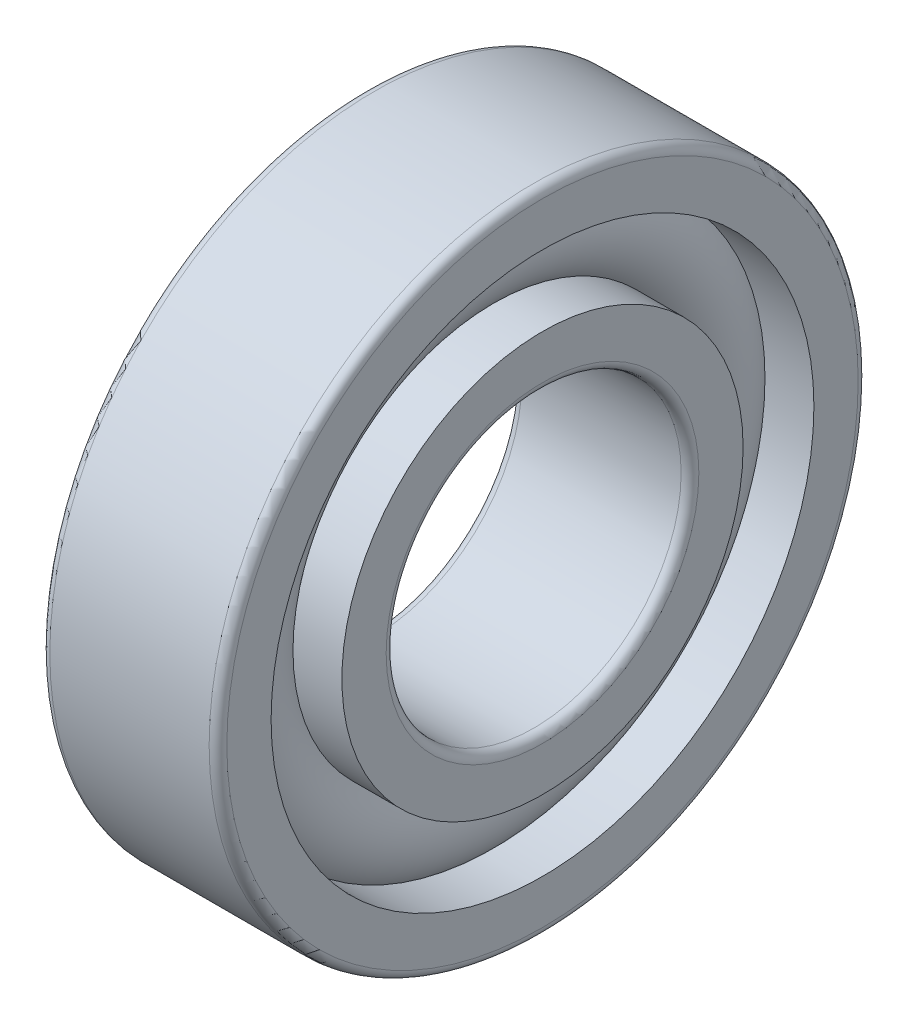
ISO-10303-21;
HEADER;
FILE_DESCRIPTION(('STEP AP214'),'2;1');
FILE_NAME('part.step','',(''),(''),'','','');
FILE_SCHEMA(('AUTOMOTIVE_DESIGN { 1 0 10303 214 1 1 1 1 }'));
ENDSEC;
DATA;
#1=APPLICATION_CONTEXT('core data for automotive mechanical design processes');
#2=APPLICATION_PROTOCOL_DEFINITION('international standard','automotive_design',2000,#1);
#3=PRODUCT_CONTEXT('',#1,'mechanical');
#4=PRODUCT('Part','Part','',(#3));
#5=PRODUCT_RELATED_PRODUCT_CATEGORY('part','',(#4));
#6=PRODUCT_DEFINITION_FORMATION('','',#4);
#7=PRODUCT_DEFINITION_CONTEXT('part definition',#1,'design');
#8=PRODUCT_DEFINITION('design','',#6,#7);
#9=PRODUCT_DEFINITION_SHAPE('','',#8);
#10=(LENGTH_UNIT() NAMED_UNIT(*) SI_UNIT(.MILLI.,.METRE.));
#11=(NAMED_UNIT(*) PLANE_ANGLE_UNIT() SI_UNIT($,.RADIAN.));
#12=(NAMED_UNIT(*) SI_UNIT($,.STERADIAN.) SOLID_ANGLE_UNIT());
#13=UNCERTAINTY_MEASURE_WITH_UNIT(LENGTH_MEASURE(1.E-05),#10,'distance_accuracy_value','');
#14=(GEOMETRIC_REPRESENTATION_CONTEXT(3) GLOBAL_UNCERTAINTY_ASSIGNED_CONTEXT((#13)) GLOBAL_UNIT_ASSIGNED_CONTEXT((#10,
#11,#12)) REPRESENTATION_CONTEXT('',''));
#15=CARTESIAN_POINT('',(0.,0.,0.));
#16=DIRECTION('',(0.,0.,1.));
#17=DIRECTION('',(1.,0.,0.));
#18=AXIS2_PLACEMENT_3D('',#15,#16,#17);
#19=CARTESIAN_POINT('',(-20.6375,0.,0.));
#20=DIRECTION('',(1.,0.,0.));
#21=DIRECTION('',(0.,0.,-1.));
#22=AXIS2_PLACEMENT_3D('',#19,#20,#21);
#23=CYLINDRICAL_SURFACE('',#22,2.5);
#24=CARTESIAN_POINT('',(1.35,0.,0.));
#25=DIRECTION('',(1.,0.,0.));
#26=DIRECTION('',(0.,0.,-1.));
#27=AXIS2_PLACEMENT_3D('',#24,#25,#26);
#28=CIRCLE('',#27,2.5);
#29=CARTESIAN_POINT('',(1.35,0.,-2.5));
#30=VERTEX_POINT('',#29);
#31=EDGE_CURVE('E68',#30,#30,#28,.F.);
#32=ORIENTED_EDGE('',*,*,#31,.F.);
#33=EDGE_LOOP('',(#32));
#34=FACE_BOUND('',#33,.T.);
#35=CARTESIAN_POINT('',(-1.35,0.,0.));
#36=DIRECTION('',(1.,0.,0.));
#37=DIRECTION('',(0.,0.,-1.));
#38=AXIS2_PLACEMENT_3D('',#35,#36,#37);
#39=CIRCLE('',#38,2.5);
#40=CARTESIAN_POINT('',(-1.35,0.,-2.5));
#41=VERTEX_POINT('',#40);
#42=EDGE_CURVE('E131',#41,#41,#39,.T.);
#43=ORIENTED_EDGE('',*,*,#42,.F.);
#44=EDGE_LOOP('',(#43));
#45=FACE_BOUND('',#44,.T.);
#46=ADVANCED_FACE('F17',(#34,#45),#23,.F.);
#47=CARTESIAN_POINT('',(-1.35,0.,0.));
#48=DIRECTION('',(1.,0.,0.));
#49=DIRECTION('',(0.,0.,-1.));
#50=AXIS2_PLACEMENT_3D('',#47,#48,#49);
#51=TOROIDAL_SURFACE('',#50,2.65,0.15);
#52=ORIENTED_EDGE('',*,*,#42,.T.);
#53=EDGE_LOOP('',(#52));
#54=FACE_BOUND('',#53,.T.);
#55=CARTESIAN_POINT('',(-1.5,0.,0.));
#56=DIRECTION('',(-1.,0.,0.));
#57=DIRECTION('',(0.,0.,-1.));
#58=AXIS2_PLACEMENT_3D('',#55,#56,#57);
#59=CIRCLE('',#58,2.65);
#60=CARTESIAN_POINT('',(-1.5,0.,2.65));
#61=VERTEX_POINT('',#60);
#62=CARTESIAN_POINT('',(-1.5,0.,-2.65));
#63=VERTEX_POINT('',#62);
#64=EDGE_CURVE('E58',#61,#63,#59,.F.);
#65=ORIENTED_EDGE('',*,*,#64,.F.);
#66=CARTESIAN_POINT('',(-1.5,0.,0.));
#67=DIRECTION('',(-1.,0.,0.));
#68=DIRECTION('',(0.,0.,1.));
#69=AXIS2_PLACEMENT_3D('',#66,#67,#68);
#70=CIRCLE('',#69,2.65);
#71=EDGE_CURVE('E56',#63,#61,#70,.F.);
#72=ORIENTED_EDGE('',*,*,#71,.F.);
#73=EDGE_LOOP('',(#65,#72));
#74=FACE_BOUND('',#73,.T.);
#75=ADVANCED_FACE('F60',(#54,#74),#51,.T.);
#76=CARTESIAN_POINT('',(1.35,0.,0.));
#77=DIRECTION('',(1.,0.,0.));
#78=DIRECTION('',(0.,0.,-1.));
#79=AXIS2_PLACEMENT_3D('',#76,#77,#78);
#80=TOROIDAL_SURFACE('',#79,2.65,0.15);
#81=CARTESIAN_POINT('',(1.5,0.,0.));
#82=DIRECTION('',(1.,0.,0.));
#83=DIRECTION('',(0.,0.,-1.));
#84=AXIS2_PLACEMENT_3D('',#81,#82,#83);
#85=CIRCLE('',#84,2.65);
#86=CARTESIAN_POINT('',(1.5,0.,2.65));
#87=VERTEX_POINT('',#86);
#88=CARTESIAN_POINT('',(1.5,0.,-2.65));
#89=VERTEX_POINT('',#88);
#90=EDGE_CURVE('E63',#87,#89,#85,.F.);
#91=ORIENTED_EDGE('',*,*,#90,.F.);
#92=CARTESIAN_POINT('',(1.5,0.,0.));
#93=DIRECTION('',(1.,0.,0.));
#94=DIRECTION('',(0.,0.,1.));
#95=AXIS2_PLACEMENT_3D('',#92,#93,#94);
#96=CIRCLE('',#95,2.65);
#97=EDGE_CURVE('E107',#89,#87,#96,.F.);
#98=ORIENTED_EDGE('',*,*,#97,.F.);
#99=EDGE_LOOP('',(#91,#98));
#100=FACE_BOUND('',#99,.T.);
#101=ORIENTED_EDGE('',*,*,#31,.T.);
#102=EDGE_LOOP('',(#101));
#103=FACE_BOUND('',#102,.T.);
#104=ADVANCED_FACE('F88',(#100,#103),#80,.T.);
#105=CARTESIAN_POINT('',(-1.5,3.4,0.));
#106=DIRECTION('',(-1.,0.,0.));
#107=DIRECTION('',(0.,0.,1.));
#108=AXIS2_PLACEMENT_3D('',#105,#106,#107);
#109=PLANE('',#108);
#110=CARTESIAN_POINT('',(-1.5,0.,0.));
#111=DIRECTION('',(1.,0.,0.));
#112=DIRECTION('',(0.,0.,-1.));
#113=AXIS2_PLACEMENT_3D('',#110,#111,#112);
#114=CIRCLE('',#113,3.4);
#115=CARTESIAN_POINT('',(-1.5,0.,-3.4));
#116=VERTEX_POINT('',#115);
#117=EDGE_CURVE('E146',#116,#116,#114,.T.);
#118=ORIENTED_EDGE('',*,*,#117,.F.);
#119=EDGE_LOOP('',(#118));
#120=FACE_BOUND('',#119,.T.);
#121=ORIENTED_EDGE('',*,*,#71,.T.);
#122=ORIENTED_EDGE('',*,*,#64,.T.);
#123=EDGE_LOOP('',(#121,#122));
#124=FACE_BOUND('',#123,.T.);
#125=ADVANCED_FACE('F67',(#120,#124),#109,.T.);
#126=CARTESIAN_POINT('',(1.5,2.65,0.));
#127=DIRECTION('',(1.,0.,0.));
#128=DIRECTION('',(0.,0.,-1.));
#129=AXIS2_PLACEMENT_3D('',#126,#127,#128);
#130=PLANE('',#129);
#131=ORIENTED_EDGE('',*,*,#90,.T.);
#132=ORIENTED_EDGE('',*,*,#97,.T.);
#133=EDGE_LOOP('',(#131,#132));
#134=FACE_BOUND('',#133,.T.);
#135=CARTESIAN_POINT('',(1.5,0.,0.));
#136=DIRECTION('',(1.,0.,0.));
#137=DIRECTION('',(0.,0.,-1.));
#138=AXIS2_PLACEMENT_3D('',#135,#136,#137);
#139=CIRCLE('',#138,3.4);
#140=CARTESIAN_POINT('',(1.5,0.,-3.4));
#141=VERTEX_POINT('',#140);
#142=EDGE_CURVE('E142',#141,#141,#139,.F.);
#143=ORIENTED_EDGE('',*,*,#142,.F.);
#144=EDGE_LOOP('',(#143));
#145=FACE_BOUND('',#144,.T.);
#146=ADVANCED_FACE('F87',(#134,#145),#130,.T.);
#147=CARTESIAN_POINT('',(-20.6375,0.,0.));
#148=DIRECTION('',(1.,0.,0.));
#149=DIRECTION('',(0.,0.,-1.));
#150=AXIS2_PLACEMENT_3D('',#147,#148,#149);
#151=CYLINDRICAL_SURFACE('',#150,3.4);
#152=ORIENTED_EDGE('',*,*,#117,.T.);
#153=EDGE_LOOP('',(#152));
#154=FACE_BOUND('',#153,.T.);
#155=CARTESIAN_POINT('',(-0.670820393249936,0.,0.));
#156=DIRECTION('',(-1.,0.,0.));
#157=DIRECTION('',(0.,0.,1.));
#158=AXIS2_PLACEMENT_3D('',#155,#156,#157);
#159=CIRCLE('',#158,3.4);
#160=CARTESIAN_POINT('',(-0.670820393249936,0.,3.4));
#161=VERTEX_POINT('',#160);
#162=EDGE_CURVE('E145',#161,#161,#159,.F.);
#163=ORIENTED_EDGE('',*,*,#162,.F.);
#164=EDGE_LOOP('',(#163));
#165=FACE_BOUND('',#164,.T.);
#166=ADVANCED_FACE('F280',(#154,#165),#151,.T.);
#167=CARTESIAN_POINT('',(-20.6375,0.,0.));
#168=DIRECTION('',(1.,0.,0.));
#169=DIRECTION('',(0.,0.,-1.));
#170=AXIS2_PLACEMENT_3D('',#167,#168,#169);
#171=CYLINDRICAL_SURFACE('',#170,3.4);
#172=CARTESIAN_POINT('',(0.670820393249936,0.,0.));
#173=DIRECTION('',(-1.,0.,0.));
#174=DIRECTION('',(0.,0.,1.));
#175=AXIS2_PLACEMENT_3D('',#172,#173,#174);
#176=CIRCLE('',#175,3.4);
#177=CARTESIAN_POINT('',(0.670820393249936,0.,3.4));
#178=VERTEX_POINT('',#177);
#179=EDGE_CURVE('E264',#178,#178,#176,.T.);
#180=ORIENTED_EDGE('',*,*,#179,.F.);
#181=EDGE_LOOP('',(#180));
#182=FACE_BOUND('',#181,.T.);
#183=ORIENTED_EDGE('',*,*,#142,.T.);
#184=EDGE_LOOP('',(#183));
#185=FACE_BOUND('',#184,.T.);
#186=ADVANCED_FACE('F259',(#182,#185),#171,.T.);
#187=CARTESIAN_POINT('',(0.,0.,0.));
#188=DIRECTION('',(-1.,0.,0.));
#189=DIRECTION('',(0.,0.,1.));
#190=AXIS2_PLACEMENT_3D('',#187,#188,#189);
#191=TOROIDAL_SURFACE('',#190,4.,0.9);
#192=CARTESIAN_POINT('',(-0.670820393249932,0.,0.));
#193=DIRECTION('',(1.,0.,0.));
#194=DIRECTION('',(0.,0.,-1.));
#195=AXIS2_PLACEMENT_3D('',#192,#193,#194);
#196=CIRCLE('',#195,4.6);
#197=CARTESIAN_POINT('',(-0.670820393249932,0.,-4.6));
#198=VERTEX_POINT('',#197);
#199=EDGE_CURVE('E263',#198,#198,#196,.F.);
#200=ORIENTED_EDGE('',*,*,#199,.T.);
#201=EDGE_LOOP('',(#200));
#202=FACE_BOUND('',#201,.T.);
#203=ORIENTED_EDGE('',*,*,#162,.T.);
#204=EDGE_LOOP('',(#203));
#205=FACE_BOUND('',#204,.T.);
#206=ADVANCED_FACE('F254',(#202,#205),#191,.T.);
#207=CARTESIAN_POINT('',(0.,0.,0.));
#208=DIRECTION('',(-1.,0.,0.));
#209=DIRECTION('',(0.,0.,1.));
#210=AXIS2_PLACEMENT_3D('',#207,#208,#209);
#211=TOROIDAL_SURFACE('',#210,4.,0.9);
#212=ORIENTED_EDGE('',*,*,#179,.T.);
#213=EDGE_LOOP('',(#212));
#214=FACE_BOUND('',#213,.T.);
#215=CARTESIAN_POINT('',(0.670820393249932,0.,0.));
#216=DIRECTION('',(1.,0.,0.));
#217=DIRECTION('',(0.,0.,-1.));
#218=AXIS2_PLACEMENT_3D('',#215,#216,#217);
#219=CIRCLE('',#218,4.6);
#220=CARTESIAN_POINT('',(0.670820393249932,0.,-4.6));
#221=VERTEX_POINT('',#220);
#222=EDGE_CURVE('E141',#221,#221,#219,.T.);
#223=ORIENTED_EDGE('',*,*,#222,.T.);
#224=EDGE_LOOP('',(#223));
#225=FACE_BOUND('',#224,.T.);
#226=ADVANCED_FACE('F249',(#214,#225),#211,.T.);
#227=CARTESIAN_POINT('',(-20.6375,0.,0.));
#228=DIRECTION('',(1.,0.,0.));
#229=DIRECTION('',(0.,0.,-1.));
#230=AXIS2_PLACEMENT_3D('',#227,#228,#229);
#231=CYLINDRICAL_SURFACE('',#230,4.6);
#232=ORIENTED_EDGE('',*,*,#199,.F.);
#233=EDGE_LOOP('',(#232));
#234=FACE_BOUND('',#233,.T.);
#235=CARTESIAN_POINT('',(-1.5,0.,0.));
#236=DIRECTION('',(1.,0.,0.));
#237=DIRECTION('',(0.,0.,-1.));
#238=AXIS2_PLACEMENT_3D('',#235,#236,#237);
#239=CIRCLE('',#238,4.6);
#240=CARTESIAN_POINT('',(-1.5,0.,-4.6));
#241=VERTEX_POINT('',#240);
#242=EDGE_CURVE('E138',#241,#241,#239,.T.);
#243=ORIENTED_EDGE('',*,*,#242,.F.);
#244=EDGE_LOOP('',(#243));
#245=FACE_BOUND('',#244,.T.);
#246=ADVANCED_FACE('F253',(#234,#245),#231,.F.);
#247=CARTESIAN_POINT('',(-20.6375,0.,0.));
#248=DIRECTION('',(1.,0.,0.));
#249=DIRECTION('',(0.,0.,-1.));
#250=AXIS2_PLACEMENT_3D('',#247,#248,#249);
#251=CYLINDRICAL_SURFACE('',#250,4.6);
#252=CARTESIAN_POINT('',(1.5,0.,0.));
#253=DIRECTION('',(1.,0.,0.));
#254=DIRECTION('',(0.,0.,-1.));
#255=AXIS2_PLACEMENT_3D('',#252,#253,#254);
#256=CIRCLE('',#255,4.6);
#257=CARTESIAN_POINT('',(1.5,0.,-4.6));
#258=VERTEX_POINT('',#257);
#259=EDGE_CURVE('E134',#258,#258,#256,.F.);
#260=ORIENTED_EDGE('',*,*,#259,.F.);
#261=EDGE_LOOP('',(#260));
#262=FACE_BOUND('',#261,.T.);
#263=ORIENTED_EDGE('',*,*,#222,.F.);
#264=EDGE_LOOP('',(#263));
#265=FACE_BOUND('',#264,.T.);
#266=ADVANCED_FACE('F336',(#262,#265),#251,.F.);
#267=CARTESIAN_POINT('',(-1.5,4.6,0.));
#268=DIRECTION('',(-1.,0.,0.));
#269=DIRECTION('',(0.,0.,1.));
#270=AXIS2_PLACEMENT_3D('',#267,#268,#269);
#271=PLANE('',#270);
#272=CARTESIAN_POINT('',(-1.5,0.,0.));
#273=DIRECTION('',(1.,0.,0.));
#274=DIRECTION('',(0.,0.,-1.));
#275=AXIS2_PLACEMENT_3D('',#272,#273,#274);
#276=CIRCLE('',#275,5.35000000000001);
#277=CARTESIAN_POINT('',(-1.5,0.,-5.35000000000001));
#278=VERTEX_POINT('',#277);
#279=CARTESIAN_POINT('',(-1.5,0.,5.35000000000001));
#280=VERTEX_POINT('',#279);
#281=EDGE_CURVE('E217',#278,#280,#276,.T.);
#282=ORIENTED_EDGE('',*,*,#281,.F.);
#283=CARTESIAN_POINT('',(-1.5,0.,0.));
#284=DIRECTION('',(1.,0.,0.));
#285=DIRECTION('',(0.,0.,1.));
#286=AXIS2_PLACEMENT_3D('',#283,#284,#285);
#287=CIRCLE('',#286,5.35000000000001);
#288=EDGE_CURVE('E137',#280,#278,#287,.T.);
#289=ORIENTED_EDGE('',*,*,#288,.F.);
#290=EDGE_LOOP('',(#282,#289));
#291=FACE_BOUND('',#290,.T.);
#292=ORIENTED_EDGE('',*,*,#242,.T.);
#293=EDGE_LOOP('',(#292));
#294=FACE_BOUND('',#293,.T.);
#295=ADVANCED_FACE('F193',(#291,#294),#271,.T.);
#296=CARTESIAN_POINT('',(1.5,5.35000000000001,0.));
#297=DIRECTION('',(1.,0.,0.));
#298=DIRECTION('',(0.,0.,-1.));
#299=AXIS2_PLACEMENT_3D('',#296,#297,#298);
#300=PLANE('',#299);
#301=ORIENTED_EDGE('',*,*,#259,.T.);
#302=EDGE_LOOP('',(#301));
#303=FACE_BOUND('',#302,.T.);
#304=CARTESIAN_POINT('',(1.5,0.,0.));
#305=DIRECTION('',(-1.,0.,0.));
#306=DIRECTION('',(0.,0.,1.));
#307=AXIS2_PLACEMENT_3D('',#304,#305,#306);
#308=CIRCLE('',#307,5.35000000000001);
#309=CARTESIAN_POINT('',(1.5,0.,5.35000000000001));
#310=VERTEX_POINT('',#309);
#311=CARTESIAN_POINT('',(1.5,0.,-5.35000000000001));
#312=VERTEX_POINT('',#311);
#313=EDGE_CURVE('E180',#310,#312,#308,.T.);
#314=ORIENTED_EDGE('',*,*,#313,.F.);
#315=CARTESIAN_POINT('',(1.5,0.,0.));
#316=DIRECTION('',(-1.,0.,0.));
#317=DIRECTION('',(0.,0.,-1.));
#318=AXIS2_PLACEMENT_3D('',#315,#316,#317);
#319=CIRCLE('',#318,5.35000000000001);
#320=EDGE_CURVE('E35',#312,#310,#319,.T.);
#321=ORIENTED_EDGE('',*,*,#320,.F.);
#322=EDGE_LOOP('',(#314,#321));
#323=FACE_BOUND('',#322,.T.);
#324=ADVANCED_FACE('F184',(#303,#323),#300,.T.);
#325=CARTESIAN_POINT('',(-1.35,0.,0.));
#326=DIRECTION('',(1.,0.,0.));
#327=DIRECTION('',(0.,0.,-1.));
#328=AXIS2_PLACEMENT_3D('',#325,#326,#327);
#329=TOROIDAL_SURFACE('',#328,5.35000000000001,0.15);
#330=CARTESIAN_POINT('',(-1.35,0.,0.));
#331=DIRECTION('',(1.,0.,0.));
#332=DIRECTION('',(0.,0.,-1.));
#333=AXIS2_PLACEMENT_3D('',#330,#331,#332);
#334=CIRCLE('',#333,5.50000000000001);
#335=CARTESIAN_POINT('',(-1.35,0.,-5.50000000000001));
#336=VERTEX_POINT('',#335);
#337=EDGE_CURVE('E27',#336,#336,#334,.T.);
#338=ORIENTED_EDGE('',*,*,#337,.F.);
#339=EDGE_LOOP('',(#338));
#340=FACE_BOUND('',#339,.T.);
#341=ORIENTED_EDGE('',*,*,#281,.T.);
#342=ORIENTED_EDGE('',*,*,#288,.T.);
#343=EDGE_LOOP('',(#341,#342));
#344=FACE_BOUND('',#343,.T.);
#345=ADVANCED_FACE('F169',(#340,#344),#329,.T.);
#346=CARTESIAN_POINT('',(1.35,0.,0.));
#347=DIRECTION('',(1.,0.,0.));
#348=DIRECTION('',(0.,0.,-1.));
#349=AXIS2_PLACEMENT_3D('',#346,#347,#348);
#350=TOROIDAL_SURFACE('',#349,5.35000000000001,0.15);
#351=ORIENTED_EDGE('',*,*,#320,.T.);
#352=ORIENTED_EDGE('',*,*,#313,.T.);
#353=EDGE_LOOP('',(#351,#352));
#354=FACE_BOUND('',#353,.T.);
#355=CARTESIAN_POINT('',(1.35,0.,0.));
#356=DIRECTION('',(1.,0.,0.));
#357=DIRECTION('',(0.,0.,-1.));
#358=AXIS2_PLACEMENT_3D('',#355,#356,#357);
#359=CIRCLE('',#358,5.50000000000001);
#360=CARTESIAN_POINT('',(1.35,0.,-5.50000000000001));
#361=VERTEX_POINT('',#360);
#362=EDGE_CURVE('E11',#361,#361,#359,.F.);
#363=ORIENTED_EDGE('',*,*,#362,.F.);
#364=EDGE_LOOP('',(#363));
#365=FACE_BOUND('',#364,.T.);
#366=ADVANCED_FACE('F157',(#354,#365),#350,.T.);
#367=CARTESIAN_POINT('',(-20.6375,0.,0.));
#368=DIRECTION('',(1.,0.,0.));
#369=DIRECTION('',(0.,0.,-1.));
#370=AXIS2_PLACEMENT_3D('',#367,#368,#369);
#371=CYLINDRICAL_SURFACE('',#370,5.50000000000001);
#372=ORIENTED_EDGE('',*,*,#362,.T.);
#373=EDGE_LOOP('',(#372));
#374=FACE_BOUND('',#373,.T.);
#375=ORIENTED_EDGE('',*,*,#337,.T.);
#376=EDGE_LOOP('',(#375));
#377=FACE_BOUND('',#376,.T.);
#378=ADVANCED_FACE('F168',(#374,#377),#371,.T.);
#379=CLOSED_SHELL('',(#46,#75,#104,#125,#146,#166,#186,#206,#226,#246,#266,#295,#324,#345,#366,#378));
#380=MANIFOLD_SOLID_BREP('B1',#379);
#381=ADVANCED_BREP_SHAPE_REPRESENTATION('',(#18,#380),#14);
#382=SHAPE_DEFINITION_REPRESENTATION(#9,#381);
ENDSEC;
END-ISO-10303-21;
